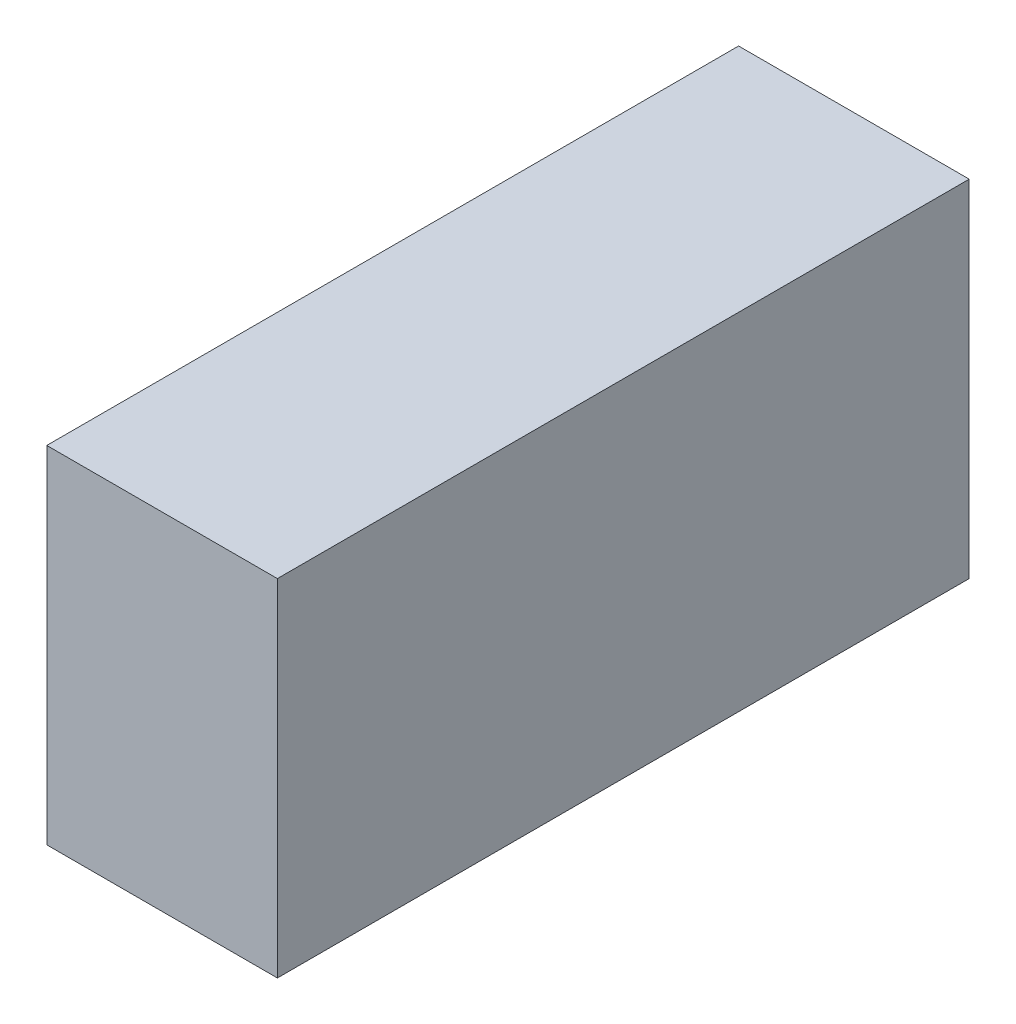
ISO-10303-21;
HEADER;
FILE_DESCRIPTION(('STEP AP214'),'2;1');
FILE_NAME('part.step','',(''),(''),'','','');
FILE_SCHEMA(('AUTOMOTIVE_DESIGN { 1 0 10303 214 1 1 1 1 }'));
ENDSEC;
DATA;
#1=APPLICATION_CONTEXT('core data for automotive mechanical design processes');
#2=APPLICATION_PROTOCOL_DEFINITION('international standard','automotive_design',2000,#1);
#3=PRODUCT_CONTEXT('',#1,'mechanical');
#4=PRODUCT('Part','Part','',(#3));
#5=PRODUCT_RELATED_PRODUCT_CATEGORY('part','',(#4));
#6=PRODUCT_DEFINITION_FORMATION('','',#4);
#7=PRODUCT_DEFINITION_CONTEXT('part definition',#1,'design');
#8=PRODUCT_DEFINITION('design','',#6,#7);
#9=PRODUCT_DEFINITION_SHAPE('','',#8);
#10=(LENGTH_UNIT() NAMED_UNIT(*) SI_UNIT(.MILLI.,.METRE.));
#11=(NAMED_UNIT(*) PLANE_ANGLE_UNIT() SI_UNIT($,.RADIAN.));
#12=(NAMED_UNIT(*) SI_UNIT($,.STERADIAN.) SOLID_ANGLE_UNIT());
#13=UNCERTAINTY_MEASURE_WITH_UNIT(LENGTH_MEASURE(1.E-05),#10,'distance_accuracy_value','');
#14=(GEOMETRIC_REPRESENTATION_CONTEXT(3) GLOBAL_UNCERTAINTY_ASSIGNED_CONTEXT((#13)) GLOBAL_UNIT_ASSIGNED_CONTEXT((#10,
#11,#12)) REPRESENTATION_CONTEXT('',''));
#15=CARTESIAN_POINT('',(0.,0.,0.));
#16=DIRECTION('',(0.,0.,1.));
#17=DIRECTION('',(1.,0.,0.));
#18=AXIS2_PLACEMENT_3D('',#15,#16,#17);
#19=CARTESIAN_POINT('',(-20.,60.,60.));
#20=DIRECTION('',(1.,0.,0.));
#21=DIRECTION('',(0.,1.,0.));
#22=AXIS2_PLACEMENT_3D('',#19,#20,#21);
#23=PLANE('',#22);
#24=DIRECTION('',(0.,-1.,0.));
#25=VECTOR('',#24,1.);
#26=CARTESIAN_POINT('',(-20.,60.,-60.));
#27=LINE('',#26,#25);
#28=CARTESIAN_POINT('',(-20.,60.,-60.));
#29=VERTEX_POINT('',#28);
#30=CARTESIAN_POINT('',(-20.,0.,-60.));
#31=VERTEX_POINT('',#30);
#32=EDGE_CURVE('E100',#29,#31,#27,.T.);
#33=ORIENTED_EDGE('',*,*,#32,.T.);
#34=DIRECTION('',(0.,0.,-1.));
#35=VECTOR('',#34,1.);
#36=CARTESIAN_POINT('',(-20.,0.,60.));
#37=LINE('',#36,#35);
#38=CARTESIAN_POINT('',(-20.,0.,60.));
#39=VERTEX_POINT('',#38);
#40=EDGE_CURVE('E11',#39,#31,#37,.T.);
#41=ORIENTED_EDGE('',*,*,#40,.F.);
#42=DIRECTION('',(0.,-1.,0.));
#43=VECTOR('',#42,1.);
#44=CARTESIAN_POINT('',(-20.,60.,60.));
#45=LINE('',#44,#43);
#46=CARTESIAN_POINT('',(-20.,60.,60.));
#47=VERTEX_POINT('',#46);
#48=EDGE_CURVE('E88',#47,#39,#45,.T.);
#49=ORIENTED_EDGE('',*,*,#48,.F.);
#50=DIRECTION('',(0.,0.,-1.));
#51=VECTOR('',#50,1.);
#52=CARTESIAN_POINT('',(-20.,60.,60.));
#53=LINE('',#52,#51);
#54=EDGE_CURVE('E96',#47,#29,#53,.T.);
#55=ORIENTED_EDGE('',*,*,#54,.T.);
#56=EDGE_LOOP('',(#33,#41,#49,#55));
#57=FACE_BOUND('',#56,.T.);
#58=ADVANCED_FACE('F37',(#57),#23,.F.);
#59=CARTESIAN_POINT('',(-20.,0.,60.));
#60=DIRECTION('',(0.,1.,0.));
#61=DIRECTION('',(0.,0.,1.));
#62=AXIS2_PLACEMENT_3D('',#59,#60,#61);
#63=PLANE('',#62);
#64=DIRECTION('',(1.,0.,0.));
#65=VECTOR('',#64,1.);
#66=CARTESIAN_POINT('',(-20.,0.,-60.));
#67=LINE('',#66,#65);
#68=CARTESIAN_POINT('',(20.,0.,-60.));
#69=VERTEX_POINT('',#68);
#70=EDGE_CURVE('E92',#31,#69,#67,.T.);
#71=ORIENTED_EDGE('',*,*,#70,.T.);
#72=DIRECTION('',(0.,0.,-1.));
#73=VECTOR('',#72,1.);
#74=CARTESIAN_POINT('',(20.,0.,60.));
#75=LINE('',#74,#73);
#76=CARTESIAN_POINT('',(20.,0.,60.));
#77=VERTEX_POINT('',#76);
#78=EDGE_CURVE('E45',#77,#69,#75,.T.);
#79=ORIENTED_EDGE('',*,*,#78,.F.);
#80=DIRECTION('',(1.,0.,0.));
#81=VECTOR('',#80,1.);
#82=CARTESIAN_POINT('',(-20.,0.,60.));
#83=LINE('',#82,#81);
#84=EDGE_CURVE('E83',#39,#77,#83,.T.);
#85=ORIENTED_EDGE('',*,*,#84,.F.);
#86=ORIENTED_EDGE('',*,*,#40,.T.);
#87=EDGE_LOOP('',(#71,#79,#85,#86));
#88=FACE_BOUND('',#87,.T.);
#89=ADVANCED_FACE('F91',(#88),#63,.F.);
#90=CARTESIAN_POINT('',(20.,60.,60.));
#91=DIRECTION('',(-1.,0.,0.));
#92=DIRECTION('',(0.,0.,1.));
#93=AXIS2_PLACEMENT_3D('',#90,#91,#92);
#94=PLANE('',#93);
#95=DIRECTION('',(0.,1.,0.));
#96=VECTOR('',#95,1.);
#97=CARTESIAN_POINT('',(20.,60.,-60.));
#98=LINE('',#97,#96);
#99=CARTESIAN_POINT('',(20.,60.,-60.));
#100=VERTEX_POINT('',#99);
#101=EDGE_CURVE('E70',#69,#100,#98,.T.);
#102=ORIENTED_EDGE('',*,*,#101,.T.);
#103=DIRECTION('',(0.,0.,-1.));
#104=VECTOR('',#103,1.);
#105=CARTESIAN_POINT('',(20.,60.,60.));
#106=LINE('',#105,#104);
#107=CARTESIAN_POINT('',(20.,60.,60.));
#108=VERTEX_POINT('',#107);
#109=EDGE_CURVE('E93',#108,#100,#106,.T.);
#110=ORIENTED_EDGE('',*,*,#109,.F.);
#111=DIRECTION('',(0.,1.,0.));
#112=VECTOR('',#111,1.);
#113=CARTESIAN_POINT('',(20.,60.,60.));
#114=LINE('',#113,#112);
#115=EDGE_CURVE('E86',#77,#108,#114,.T.);
#116=ORIENTED_EDGE('',*,*,#115,.F.);
#117=ORIENTED_EDGE('',*,*,#78,.T.);
#118=EDGE_LOOP('',(#102,#110,#116,#117));
#119=FACE_BOUND('',#118,.T.);
#120=ADVANCED_FACE('F94',(#119),#94,.F.);
#121=CARTESIAN_POINT('',(-20.,60.,60.));
#122=DIRECTION('',(0.,-1.,0.));
#123=DIRECTION('',(0.,0.,-1.));
#124=AXIS2_PLACEMENT_3D('',#121,#122,#123);
#125=PLANE('',#124);
#126=DIRECTION('',(-1.,0.,0.));
#127=VECTOR('',#126,1.);
#128=CARTESIAN_POINT('',(-20.,60.,-60.));
#129=LINE('',#128,#127);
#130=EDGE_CURVE('E76',#100,#29,#129,.T.);
#131=ORIENTED_EDGE('',*,*,#130,.T.);
#132=ORIENTED_EDGE('',*,*,#54,.F.);
#133=DIRECTION('',(-1.,0.,0.));
#134=VECTOR('',#133,1.);
#135=CARTESIAN_POINT('',(-20.,60.,60.));
#136=LINE('',#135,#134);
#137=EDGE_CURVE('E53',#108,#47,#136,.T.);
#138=ORIENTED_EDGE('',*,*,#137,.F.);
#139=ORIENTED_EDGE('',*,*,#109,.T.);
#140=EDGE_LOOP('',(#131,#132,#138,#139));
#141=FACE_BOUND('',#140,.T.);
#142=ADVANCED_FACE('F107',(#141),#125,.F.);
#143=CARTESIAN_POINT('',(0.,0.,60.));
#144=DIRECTION('',(0.,0.,1.));
#145=DIRECTION('',(1.,0.,0.));
#146=AXIS2_PLACEMENT_3D('',#143,#144,#145);
#147=PLANE('',#146);
#148=ORIENTED_EDGE('',*,*,#48,.T.);
#149=ORIENTED_EDGE('',*,*,#84,.T.);
#150=ORIENTED_EDGE('',*,*,#115,.T.);
#151=ORIENTED_EDGE('',*,*,#137,.T.);
#152=EDGE_LOOP('',(#148,#149,#150,#151));
#153=FACE_BOUND('',#152,.T.);
#154=ADVANCED_FACE('F84',(#153),#147,.T.);
#155=CARTESIAN_POINT('',(0.,0.,-60.));
#156=DIRECTION('',(0.,0.,1.));
#157=DIRECTION('',(1.,0.,0.));
#158=AXIS2_PLACEMENT_3D('',#155,#156,#157);
#159=PLANE('',#158);
#160=ORIENTED_EDGE('',*,*,#32,.F.);
#161=ORIENTED_EDGE('',*,*,#130,.F.);
#162=ORIENTED_EDGE('',*,*,#101,.F.);
#163=ORIENTED_EDGE('',*,*,#70,.F.);
#164=EDGE_LOOP('',(#160,#161,#162,#163));
#165=FACE_BOUND('',#164,.T.);
#166=ADVANCED_FACE('F110',(#165),#159,.F.);
#167=CLOSED_SHELL('',(#58,#89,#120,#142,#154,#166));
#168=MANIFOLD_SOLID_BREP('B2',#167);
#169=ADVANCED_BREP_SHAPE_REPRESENTATION('',(#18,#168),#14);
#170=SHAPE_DEFINITION_REPRESENTATION(#9,#169);
ENDSEC;
END-ISO-10303-21;
